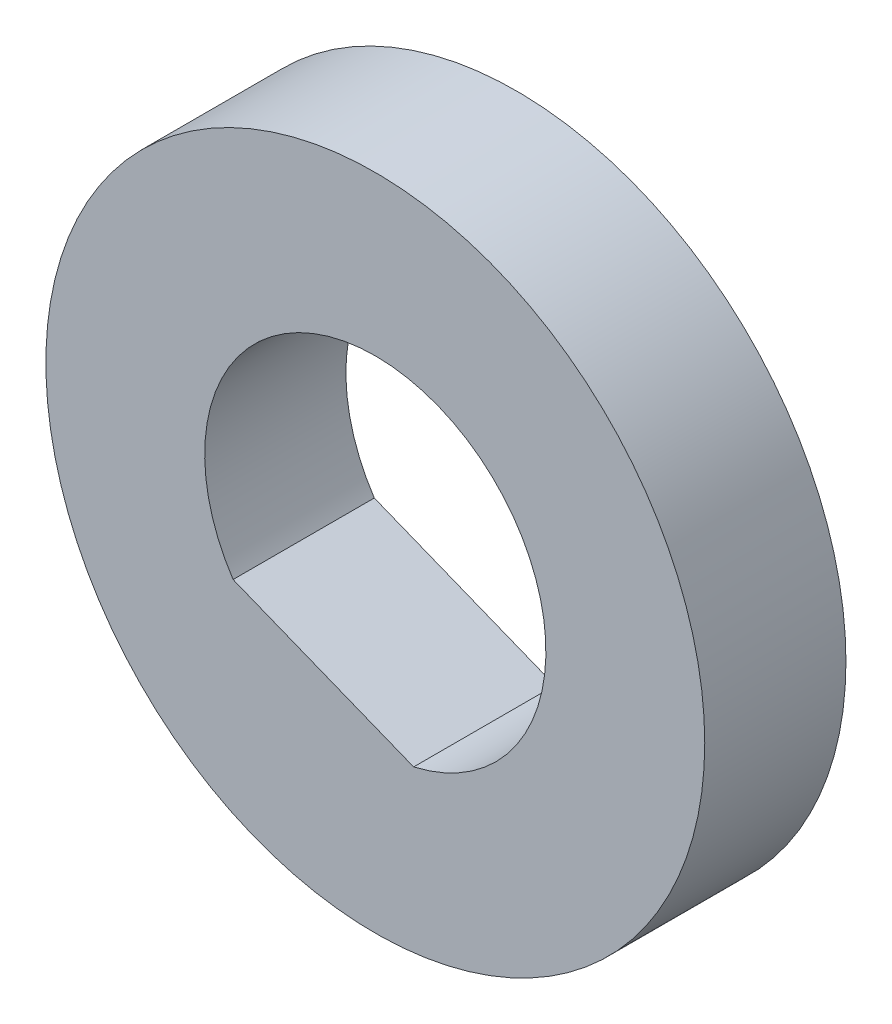
ISO-10303-21;
HEADER;
FILE_DESCRIPTION(('STEP AP214'),'2;1');
FILE_NAME('part.step','',(''),(''),'','','');
FILE_SCHEMA(('AUTOMOTIVE_DESIGN { 1 0 10303 214 1 1 1 1 }'));
ENDSEC;
DATA;
#1=APPLICATION_CONTEXT('core data for automotive mechanical design processes');
#2=APPLICATION_PROTOCOL_DEFINITION('international standard','automotive_design',2000,#1);
#3=PRODUCT_CONTEXT('',#1,'mechanical');
#4=PRODUCT('Part','Part','',(#3));
#5=PRODUCT_RELATED_PRODUCT_CATEGORY('part','',(#4));
#6=PRODUCT_DEFINITION_FORMATION('','',#4);
#7=PRODUCT_DEFINITION_CONTEXT('part definition',#1,'design');
#8=PRODUCT_DEFINITION('design','',#6,#7);
#9=PRODUCT_DEFINITION_SHAPE('','',#8);
#10=(LENGTH_UNIT() NAMED_UNIT(*) SI_UNIT(.MILLI.,.METRE.));
#11=(NAMED_UNIT(*) PLANE_ANGLE_UNIT() SI_UNIT($,.RADIAN.));
#12=(NAMED_UNIT(*) SI_UNIT($,.STERADIAN.) SOLID_ANGLE_UNIT());
#13=UNCERTAINTY_MEASURE_WITH_UNIT(LENGTH_MEASURE(1.E-05),#10,'distance_accuracy_value','');
#14=(GEOMETRIC_REPRESENTATION_CONTEXT(3) GLOBAL_UNCERTAINTY_ASSIGNED_CONTEXT((#13)) GLOBAL_UNIT_ASSIGNED_CONTEXT((#10,
#11,#12)) REPRESENTATION_CONTEXT('',''));
#15=CARTESIAN_POINT('',(0.,0.,0.));
#16=DIRECTION('',(0.,0.,1.));
#17=DIRECTION('',(1.,0.,0.));
#18=AXIS2_PLACEMENT_3D('',#15,#16,#17);
#19=CARTESIAN_POINT('',(0.,0.,6.));
#20=DIRECTION('',(0.,0.,1.));
#21=DIRECTION('',(1.,0.,0.));
#22=AXIS2_PLACEMENT_3D('',#19,#20,#21);
#23=PLANE('',#22);
#24=CARTESIAN_POINT('',(0.,0.,6.));
#25=DIRECTION('',(0.,0.,1.));
#26=DIRECTION('',(1.,0.,0.));
#27=AXIS2_PLACEMENT_3D('',#24,#25,#26);
#28=CIRCLE('',#27,14.);
#29=CARTESIAN_POINT('',(14.,0.,6.));
#30=VERTEX_POINT('',#29);
#31=EDGE_CURVE('E11',#30,#30,#28,.T.);
#32=ORIENTED_EDGE('',*,*,#31,.T.);
#33=EDGE_LOOP('',(#32));
#34=FACE_BOUND('',#33,.T.);
#35=DIRECTION('',(-0.928844495663221,0.370469840710598,0.));
#36=VECTOR('',#35,1.);
#37=CARTESIAN_POINT('',(-2.20750291967166,-5.53466628259022,6.));
#38=LINE('',#37,#36);
#39=CARTESIAN_POINT('',(1.62862484741744,-7.06470672472499,6.));
#40=VERTEX_POINT('',#39);
#41=CARTESIAN_POINT('',(-6.04363068676077,-4.00462584045545,6.));
#42=VERTEX_POINT('',#41);
#43=EDGE_CURVE('E72',#40,#42,#38,.T.);
#44=ORIENTED_EDGE('',*,*,#43,.T.);
#45=CARTESIAN_POINT('',(0.,0.,6.));
#46=DIRECTION('',(0.,0.,1.));
#47=DIRECTION('',(1.,0.,0.));
#48=AXIS2_PLACEMENT_3D('',#45,#46,#47);
#49=CIRCLE('',#48,7.25);
#50=EDGE_CURVE('E69',#42,#40,#49,.F.);
#51=ORIENTED_EDGE('',*,*,#50,.T.);
#52=EDGE_LOOP('',(#44,#51));
#53=FACE_BOUND('',#52,.T.);
#54=ADVANCED_FACE('F39',(#34,#53),#23,.T.);
#55=CARTESIAN_POINT('',(0.,0.,0.));
#56=DIRECTION('',(0.,0.,1.));
#57=DIRECTION('',(1.,0.,0.));
#58=AXIS2_PLACEMENT_3D('',#55,#56,#57);
#59=PLANE('',#58);
#60=CARTESIAN_POINT('',(0.,0.,0.));
#61=DIRECTION('',(0.,0.,1.));
#62=DIRECTION('',(1.,0.,0.));
#63=AXIS2_PLACEMENT_3D('',#60,#61,#62);
#64=CIRCLE('',#63,14.);
#65=CARTESIAN_POINT('',(14.,0.,0.));
#66=VERTEX_POINT('',#65);
#67=EDGE_CURVE('E43',#66,#66,#64,.T.);
#68=ORIENTED_EDGE('',*,*,#67,.F.);
#69=EDGE_LOOP('',(#68));
#70=FACE_BOUND('',#69,.T.);
#71=CARTESIAN_POINT('',(0.,0.,0.));
#72=DIRECTION('',(0.,0.,1.));
#73=DIRECTION('',(-1.,0.,0.));
#74=AXIS2_PLACEMENT_3D('',#71,#72,#73);
#75=CIRCLE('',#74,7.25);
#76=CARTESIAN_POINT('',(1.62862484741744,-7.06470672472499,0.));
#77=VERTEX_POINT('',#76);
#78=CARTESIAN_POINT('',(-6.04363068676077,-4.00462584045545,0.));
#79=VERTEX_POINT('',#78);
#80=EDGE_CURVE('E62',#77,#79,#75,.T.);
#81=ORIENTED_EDGE('',*,*,#80,.T.);
#82=DIRECTION('',(0.928844495663222,-0.370469840710598,0.));
#83=VECTOR('',#82,1.);
#84=CARTESIAN_POINT('',(1.62862484741744,-7.06470672472499,0.));
#85=LINE('',#84,#83);
#86=EDGE_CURVE('E76',#79,#77,#85,.T.);
#87=ORIENTED_EDGE('',*,*,#86,.T.);
#88=EDGE_LOOP('',(#81,#87));
#89=FACE_BOUND('',#88,.T.);
#90=ADVANCED_FACE('F81',(#70,#89),#59,.F.);
#91=CARTESIAN_POINT('',(0.,0.,6.));
#92=DIRECTION('',(0.,0.,-1.));
#93=DIRECTION('',(-1.,0.,0.));
#94=AXIS2_PLACEMENT_3D('',#91,#92,#93);
#95=CYLINDRICAL_SURFACE('',#94,14.);
#96=ORIENTED_EDGE('',*,*,#31,.F.);
#97=EDGE_LOOP('',(#96));
#98=FACE_BOUND('',#97,.T.);
#99=ORIENTED_EDGE('',*,*,#67,.T.);
#100=EDGE_LOOP('',(#99));
#101=FACE_BOUND('',#100,.T.);
#102=ADVANCED_FACE('F41',(#98,#101),#95,.T.);
#103=CARTESIAN_POINT('',(0.,0.,16.));
#104=DIRECTION('',(0.,0.,-1.));
#105=DIRECTION('',(-1.,0.,0.));
#106=AXIS2_PLACEMENT_3D('',#103,#104,#105);
#107=CYLINDRICAL_SURFACE('',#106,7.25);
#108=DIRECTION('',(0.,0.,-1.));
#109=VECTOR('',#108,1.);
#110=CARTESIAN_POINT('',(-6.04363068676077,-4.00462584045545,16.));
#111=LINE('',#110,#109);
#112=EDGE_CURVE('E55',#42,#79,#111,.T.);
#113=ORIENTED_EDGE('',*,*,#112,.T.);
#114=ORIENTED_EDGE('',*,*,#80,.F.);
#115=DIRECTION('',(0.,0.,-1.));
#116=VECTOR('',#115,1.);
#117=CARTESIAN_POINT('',(1.62862484741744,-7.06470672472499,16.));
#118=LINE('',#117,#116);
#119=EDGE_CURVE('E73',#40,#77,#118,.T.);
#120=ORIENTED_EDGE('',*,*,#119,.F.);
#121=ORIENTED_EDGE('',*,*,#50,.F.);
#122=EDGE_LOOP('',(#113,#114,#120,#121));
#123=FACE_BOUND('',#122,.T.);
#124=ADVANCED_FACE('F67',(#123),#107,.F.);
#125=CARTESIAN_POINT('',(1.62862484741744,-7.06470672472499,16.));
#126=DIRECTION('',(0.370469840710598,0.928844495663221,0.));
#127=DIRECTION('',(-0.928844495663221,0.370469840710598,0.));
#128=AXIS2_PLACEMENT_3D('',#125,#126,#127);
#129=PLANE('',#128);
#130=ORIENTED_EDGE('',*,*,#119,.T.);
#131=ORIENTED_EDGE('',*,*,#86,.F.);
#132=ORIENTED_EDGE('',*,*,#112,.F.);
#133=ORIENTED_EDGE('',*,*,#43,.F.);
#134=EDGE_LOOP('',(#130,#131,#132,#133));
#135=FACE_BOUND('',#134,.T.);
#136=ADVANCED_FACE('F77',(#135),#129,.T.);
#137=CLOSED_SHELL('',(#54,#90,#102,#124,#136));
#138=MANIFOLD_SOLID_BREP('B2',#137);
#139=ADVANCED_BREP_SHAPE_REPRESENTATION('',(#18,#138),#14);
#140=SHAPE_DEFINITION_REPRESENTATION(#9,#139);
ENDSEC;
END-ISO-10303-21;
